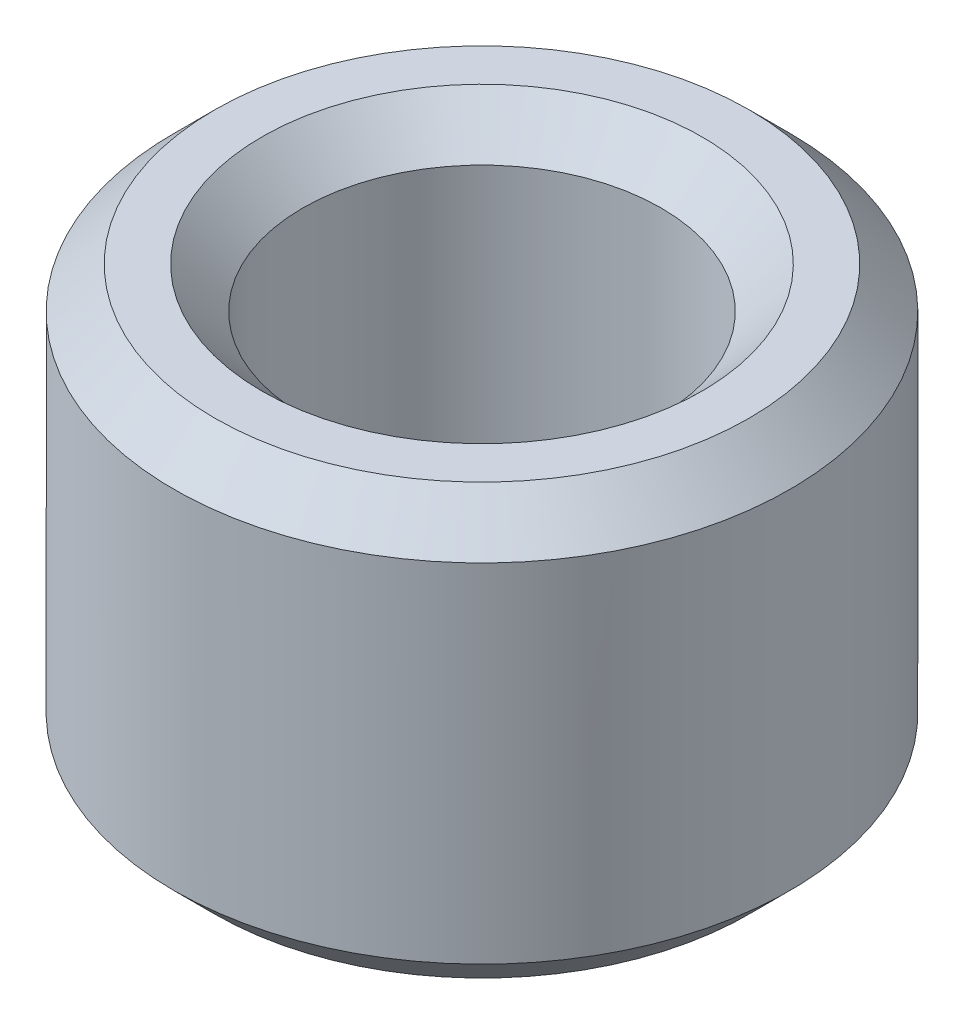
ISO-10303-21;
HEADER;
FILE_DESCRIPTION(('STEP AP214'),'2;1');
FILE_NAME('part.step','',(''),(''),'','','');
FILE_SCHEMA(('AUTOMOTIVE_DESIGN { 1 0 10303 214 1 1 1 1 }'));
ENDSEC;
DATA;
#1=APPLICATION_CONTEXT('core data for automotive mechanical design processes');
#2=APPLICATION_PROTOCOL_DEFINITION('international standard','automotive_design',2000,#1);
#3=PRODUCT_CONTEXT('',#1,'mechanical');
#4=PRODUCT('Part','Part','',(#3));
#5=PRODUCT_RELATED_PRODUCT_CATEGORY('part','',(#4));
#6=PRODUCT_DEFINITION_FORMATION('','',#4);
#7=PRODUCT_DEFINITION_CONTEXT('part definition',#1,'design');
#8=PRODUCT_DEFINITION('design','',#6,#7);
#9=PRODUCT_DEFINITION_SHAPE('','',#8);
#10=(LENGTH_UNIT() NAMED_UNIT(*) SI_UNIT(.MILLI.,.METRE.));
#11=(NAMED_UNIT(*) PLANE_ANGLE_UNIT() SI_UNIT($,.RADIAN.));
#12=(NAMED_UNIT(*) SI_UNIT($,.STERADIAN.) SOLID_ANGLE_UNIT());
#13=UNCERTAINTY_MEASURE_WITH_UNIT(LENGTH_MEASURE(1.E-05),#10,'distance_accuracy_value','');
#14=(GEOMETRIC_REPRESENTATION_CONTEXT(3) GLOBAL_UNCERTAINTY_ASSIGNED_CONTEXT((#13)) GLOBAL_UNIT_ASSIGNED_CONTEXT((#10,
#11,#12)) REPRESENTATION_CONTEXT('',''));
#15=CARTESIAN_POINT('',(0.,0.,0.));
#16=DIRECTION('',(0.,0.,1.));
#17=DIRECTION('',(1.,0.,0.));
#18=AXIS2_PLACEMENT_3D('',#15,#16,#17);
#19=CARTESIAN_POINT('',(0.,27.8746559785749,0.));
#20=DIRECTION('',(0.,-1.,0.));
#21=DIRECTION('',(0.,0.,-1.));
#22=AXIS2_PLACEMENT_3D('',#19,#20,#21);
#23=CYLINDRICAL_SURFACE('',#22,20.);
#24=CARTESIAN_POINT('',(0.,2.66226070512291,0.));
#25=DIRECTION('',(0.,1.,0.));
#26=DIRECTION('',(0.,0.,1.));
#27=AXIS2_PLACEMENT_3D('',#24,#25,#26);
#28=CIRCLE('',#27,20.);
#29=CARTESIAN_POINT('',(0.,2.66226070512291,-20.));
#30=VERTEX_POINT('',#29);
#31=EDGE_CURVE('E10',#30,#30,#28,.T.);
#32=CARTESIAN_POINT('',(0.,25.212395273452,0.));
#33=DIRECTION('',(0.,1.,0.));
#34=DIRECTION('',(0.,0.,1.));
#35=AXIS2_PLACEMENT_3D('',#32,#33,#34);
#36=CIRCLE('',#35,20.);
#37=CARTESIAN_POINT('',(0.,25.212395273452,-20.));
#38=VERTEX_POINT('',#37);
#39=EDGE_CURVE('E50',#38,#38,#36,.F.);
#40=CARTESIAN_POINT('',(0.,2.66226070512291,-20.));
#41=CARTESIAN_POINT('',(0.,2.89715794020967,-20.));
#42=CARTESIAN_POINT('',(0.,3.13205517529643,-20.));
#43=CARTESIAN_POINT('',(0.,3.60184964546995,-20.));
#44=CARTESIAN_POINT('',(0.,3.83674688055671,-20.));
#45=CARTESIAN_POINT('',(0.,4.30654135073024,-20.));
#46=CARTESIAN_POINT('',(0.,4.541438585817,-20.));
#47=CARTESIAN_POINT('',(0.,5.01123305599052,-20.));
#48=CARTESIAN_POINT('',(0.,5.24613029107728,-20.));
#49=CARTESIAN_POINT('',(0.,5.7159247612508,-20.));
#50=CARTESIAN_POINT('',(0.,5.95082199633757,-20.));
#51=CARTESIAN_POINT('',(0.,6.42061646651109,-20.));
#52=CARTESIAN_POINT('',(0.,6.65551370159785,-20.));
#53=CARTESIAN_POINT('',(0.,7.12530817177137,-20.));
#54=CARTESIAN_POINT('',(0.,7.36020540685813,-20.));
#55=CARTESIAN_POINT('',(0.,7.82999987703166,-20.));
#56=CARTESIAN_POINT('',(0.,8.06489711211842,-20.));
#57=CARTESIAN_POINT('',(0.,8.53469158229194,-20.));
#58=CARTESIAN_POINT('',(0.,8.7695888173787,-20.));
#59=CARTESIAN_POINT('',(0.,9.23938328755222,-20.));
#60=CARTESIAN_POINT('',(0.,9.47428052263898,-20.));
#61=CARTESIAN_POINT('',(0.,9.94407499281251,-20.));
#62=CARTESIAN_POINT('',(0.,10.1789722278993,-20.));
#63=CARTESIAN_POINT('',(0.,10.6487666980728,-20.));
#64=CARTESIAN_POINT('',(0.,10.8836639331596,-20.));
#65=CARTESIAN_POINT('',(0.,11.3534584033331,-20.));
#66=CARTESIAN_POINT('',(0.,11.5883556384198,-20.));
#67=CARTESIAN_POINT('',(0.,12.0581501085934,-20.));
#68=CARTESIAN_POINT('',(0.,12.2930473436801,-20.));
#69=CARTESIAN_POINT('',(0.,12.7628418138536,-20.));
#70=CARTESIAN_POINT('',(0.,12.9977390489404,-20.));
#71=CARTESIAN_POINT('',(0.,13.4675335191139,-20.));
#72=CARTESIAN_POINT('',(0.,13.7024307542007,-20.));
#73=CARTESIAN_POINT('',(0.,14.1722252243742,-20.));
#74=CARTESIAN_POINT('',(0.,14.407122459461,-20.));
#75=CARTESIAN_POINT('',(0.,14.8769169296345,-20.));
#76=CARTESIAN_POINT('',(0.,15.1118141647213,-20.));
#77=CARTESIAN_POINT('',(0.,15.5816086348948,-20.));
#78=CARTESIAN_POINT('',(0.,15.8165058699815,-20.));
#79=CARTESIAN_POINT('',(0.,16.2863003401551,-20.));
#80=CARTESIAN_POINT('',(0.,16.5211975752418,-20.));
#81=CARTESIAN_POINT('',(0.,16.9909920454153,-20.));
#82=CARTESIAN_POINT('',(0.,17.2258892805021,-20.));
#83=CARTESIAN_POINT('',(0.,17.6956837506756,-20.));
#84=CARTESIAN_POINT('',(0.,17.9305809857624,-20.));
#85=CARTESIAN_POINT('',(0.,18.4003754559359,-20.));
#86=CARTESIAN_POINT('',(0.,18.6352726910227,-20.));
#87=CARTESIAN_POINT('',(0.,19.1050671611962,-20.));
#88=CARTESIAN_POINT('',(0.,19.339964396283,-20.));
#89=CARTESIAN_POINT('',(0.,19.8097588664565,-20.));
#90=CARTESIAN_POINT('',(0.,20.0446561015432,-20.));
#91=CARTESIAN_POINT('',(0.,20.5144505717168,-20.));
#92=CARTESIAN_POINT('',(0.,20.7493478068035,-20.));
#93=CARTESIAN_POINT('',(0.,21.219142276977,-20.));
#94=CARTESIAN_POINT('',(0.,21.4540395120638,-20.));
#95=CARTESIAN_POINT('',(0.,21.9238339822373,-20.));
#96=CARTESIAN_POINT('',(0.,22.1587312173241,-20.));
#97=CARTESIAN_POINT('',(0.,22.6285256874976,-20.));
#98=CARTESIAN_POINT('',(0.,22.8634229225844,-20.));
#99=CARTESIAN_POINT('',(0.,23.3332173927579,-20.));
#100=CARTESIAN_POINT('',(0.,23.5681146278447,-20.));
#101=CARTESIAN_POINT('',(0.,24.0379090980182,-20.));
#102=CARTESIAN_POINT('',(0.,24.2728063331049,-20.));
#103=CARTESIAN_POINT('',(0.,24.7426008032785,-20.));
#104=CARTESIAN_POINT('',(0.,24.9774980383652,-20.));
#105=CARTESIAN_POINT('',(0.,25.212395273452,-20.));
#106=B_SPLINE_CURVE_WITH_KNOTS('',3,(#40,#41,#42,#43,#44,#45,#46,#47,#48,#49,#50,#51,#52,#53,
#54,#55,#56,#57,#58,#59,#60,#61,#62,#63,#64,#65,#66,#67,#68,#69,#70,#71,#72,#73,#74,#75,#76,#77,
#78,#79,#80,#81,#82,#83,#84,#85,#86,#87,#88,#89,#90,#91,#92,#93,#94,#95,#96,#97,#98,#99,#100,
#101,#102,#103,#104,#105),.UNSPECIFIED.,.F.,.F.,(4,2,2,2,2,2,2,2,2,2,2,2,2,2,2,2,2,2,2,2,2,2,2,
2,2,2,2,2,2,2,2,2,4),(0.,0.704691705260285,1.40938341052057,2.11407511578085,2.81876682104113,
3.52345852630142,4.2281502315617,4.93284193682199,5.63753364208227,6.34222534734255,
7.04691705260284,7.75160875786312,8.45630046312341,9.16099216838369,9.86568387364397,
10.5703755789043,11.2750672841645,11.9797589894248,12.6844506946851,13.3891423999454,
14.0938341052057,14.798525810466,15.5032175157262,16.2079092209865,16.9126009262468,
17.6172926315071,18.3219843367674,19.0266760420277,19.7313677472879,20.4360594525482,
21.1407511578085,21.8454428630688,22.5501345683291),.UNSPECIFIED.);
#107=EDGE_CURVE('BSEAM39',#30,#38,#106,.T.);
#108=ORIENTED_EDGE('',*,*,#31,.T.);
#109=ORIENTED_EDGE('',*,*,#39,.T.);
#110=ORIENTED_EDGE('',*,*,#107,.T.);
#111=ORIENTED_EDGE('',*,*,#107,.F.);
#112=EDGE_LOOP('',(#108,#110,#109,#111));
#113=FACE_BOUND('',#112,.T.);
#114=ADVANCED_FACE('F39',(#113),#23,.T.);
#115=CARTESIAN_POINT('',(0.,27.8746559785749,0.));
#116=DIRECTION('',(0.,1.,0.));
#117=DIRECTION('',(0.,0.,1.));
#118=AXIS2_PLACEMENT_3D('',#115,#116,#117);
#119=PLANE('',#118);
#120=CARTESIAN_POINT('',(0.,27.8746559785749,0.));
#121=DIRECTION('',(0.,1.,0.));
#122=DIRECTION('',(0.,0.,1.));
#123=AXIS2_PLACEMENT_3D('',#120,#121,#122);
#124=CIRCLE('',#123,14.2882982925674);
#125=CARTESIAN_POINT('',(0.,27.8746559785749,14.2882982925674));
#126=VERTEX_POINT('',#125);
#127=EDGE_CURVE('E58',#126,#126,#124,.F.);
#128=ORIENTED_EDGE('',*,*,#127,.T.);
#129=EDGE_LOOP('',(#128));
#130=FACE_BOUND('',#129,.T.);
#131=CARTESIAN_POINT('',(0.,27.8746559785749,0.));
#132=DIRECTION('',(0.,1.,0.));
#133=DIRECTION('',(0.,0.,1.));
#134=AXIS2_PLACEMENT_3D('',#131,#132,#133);
#135=CIRCLE('',#134,17.3377392948772);
#136=CARTESIAN_POINT('',(0.,27.8746559785749,17.3377392948772));
#137=VERTEX_POINT('',#136);
#138=EDGE_CURVE('E61',#137,#137,#135,.T.);
#139=ORIENTED_EDGE('',*,*,#138,.T.);
#140=EDGE_LOOP('',(#139));
#141=FACE_BOUND('',#140,.T.);
#142=ADVANCED_FACE('F88',(#130,#141),#119,.T.);
#143=CARTESIAN_POINT('',(0.,0.,0.));
#144=DIRECTION('',(0.,1.,0.));
#145=DIRECTION('',(0.,0.,1.));
#146=AXIS2_PLACEMENT_3D('',#143,#144,#145);
#147=PLANE('',#146);
#148=CARTESIAN_POINT('',(0.,0.,0.));
#149=DIRECTION('',(0.,1.,0.));
#150=DIRECTION('',(0.,0.,1.));
#151=AXIS2_PLACEMENT_3D('',#148,#149,#150);
#152=CIRCLE('',#151,14.2882982925673);
#153=CARTESIAN_POINT('',(0.,0.,14.2882982925673));
#154=VERTEX_POINT('',#153);
#155=EDGE_CURVE('E51',#154,#154,#152,.T.);
#156=ORIENTED_EDGE('',*,*,#155,.T.);
#157=EDGE_LOOP('',(#156));
#158=FACE_BOUND('',#157,.T.);
#159=CARTESIAN_POINT('',(0.,0.,0.));
#160=DIRECTION('',(0.,1.,0.));
#161=DIRECTION('',(0.,0.,1.));
#162=AXIS2_PLACEMENT_3D('',#159,#160,#161);
#163=CIRCLE('',#162,17.3377392948771);
#164=CARTESIAN_POINT('',(0.,0.,17.3377392948771));
#165=VERTEX_POINT('',#164);
#166=EDGE_CURVE('E54',#165,#165,#163,.F.);
#167=ORIENTED_EDGE('',*,*,#166,.T.);
#168=EDGE_LOOP('',(#167));
#169=FACE_BOUND('',#168,.T.);
#170=ADVANCED_FACE('F83',(#158,#169),#147,.F.);
#171=CARTESIAN_POINT('',(0.,27.8746559785749,0.));
#172=DIRECTION('',(0.,-1.,0.));
#173=DIRECTION('',(0.,0.,-1.));
#174=AXIS2_PLACEMENT_3D('',#171,#172,#173);
#175=CYLINDRICAL_SURFACE('',#174,11.6260375874445);
#176=CARTESIAN_POINT('',(0.,25.212395273452,0.));
#177=DIRECTION('',(0.,1.,0.));
#178=DIRECTION('',(0.,0.,1.));
#179=AXIS2_PLACEMENT_3D('',#176,#177,#178);
#180=CIRCLE('',#179,11.6260375874445);
#181=CARTESIAN_POINT('',(0.,25.212395273452,-11.6260375874445));
#182=VERTEX_POINT('',#181);
#183=EDGE_CURVE('E67',#182,#182,#180,.T.);
#184=CARTESIAN_POINT('',(0.,2.66226070512286,0.));
#185=DIRECTION('',(0.,1.,0.));
#186=DIRECTION('',(0.,0.,1.));
#187=AXIS2_PLACEMENT_3D('',#184,#185,#186);
#188=CIRCLE('',#187,11.6260375874445);
#189=CARTESIAN_POINT('',(0.,2.66226070512286,-11.6260375874445));
#190=VERTEX_POINT('',#189);
#191=EDGE_CURVE('E69',#190,#190,#188,.F.);
#192=CARTESIAN_POINT('',(0.,25.212395273452,-11.6260375874445));
#193=CARTESIAN_POINT('',(0.,24.9774980383652,-11.6260375874445));
#194=CARTESIAN_POINT('',(0.,24.7426008032784,-11.6260375874445));
#195=CARTESIAN_POINT('',(0.,24.2728063331049,-11.6260375874445));
#196=CARTESIAN_POINT('',(0.,24.0379090980182,-11.6260375874445));
#197=CARTESIAN_POINT('',(0.,23.5681146278446,-11.6260375874445));
#198=CARTESIAN_POINT('',(0.,23.3332173927579,-11.6260375874445));
#199=CARTESIAN_POINT('',(0.,22.8634229225844,-11.6260375874445));
#200=CARTESIAN_POINT('',(0.,22.6285256874976,-11.6260375874445));
#201=CARTESIAN_POINT('',(0.,22.1587312173241,-11.6260375874445));
#202=CARTESIAN_POINT('',(0.,21.9238339822373,-11.6260375874445));
#203=CARTESIAN_POINT('',(0.,21.4540395120638,-11.6260375874445));
#204=CARTESIAN_POINT('',(0.,21.219142276977,-11.6260375874445));
#205=CARTESIAN_POINT('',(0.,20.7493478068035,-11.6260375874445));
#206=CARTESIAN_POINT('',(0.,20.5144505717167,-11.6260375874445));
#207=CARTESIAN_POINT('',(0.,20.0446561015432,-11.6260375874445));
#208=CARTESIAN_POINT('',(0.,19.8097588664565,-11.6260375874445));
#209=CARTESIAN_POINT('',(0.,19.3399643962829,-11.6260375874445));
#210=CARTESIAN_POINT('',(0.,19.1050671611962,-11.6260375874445));
#211=CARTESIAN_POINT('',(0.,18.6352726910226,-11.6260375874445));
#212=CARTESIAN_POINT('',(0.,18.4003754559359,-11.6260375874445));
#213=CARTESIAN_POINT('',(0.,17.9305809857624,-11.6260375874445));
#214=CARTESIAN_POINT('',(0.,17.6956837506756,-11.6260375874445));
#215=CARTESIAN_POINT('',(0.,17.2258892805021,-11.6260375874445));
#216=CARTESIAN_POINT('',(0.,16.9909920454153,-11.6260375874445));
#217=CARTESIAN_POINT('',(0.,16.5211975752418,-11.6260375874445));
#218=CARTESIAN_POINT('',(0.,16.286300340155,-11.6260375874445));
#219=CARTESIAN_POINT('',(0.,15.8165058699815,-11.6260375874445));
#220=CARTESIAN_POINT('',(0.,15.5816086348947,-11.6260375874445));
#221=CARTESIAN_POINT('',(0.,15.1118141647212,-11.6260375874445));
#222=CARTESIAN_POINT('',(0.,14.8769169296345,-11.6260375874445));
#223=CARTESIAN_POINT('',(0.,14.4071224594609,-11.6260375874445));
#224=CARTESIAN_POINT('',(0.,14.1722252243742,-11.6260375874445));
#225=CARTESIAN_POINT('',(0.,13.7024307542007,-11.6260375874445));
#226=CARTESIAN_POINT('',(0.,13.4675335191139,-11.6260375874445));
#227=CARTESIAN_POINT('',(0.,12.9977390489404,-11.6260375874445));
#228=CARTESIAN_POINT('',(0.,12.7628418138536,-11.6260375874445));
#229=CARTESIAN_POINT('',(0.,12.2930473436801,-11.6260375874445));
#230=CARTESIAN_POINT('',(0.,12.0581501085933,-11.6260375874445));
#231=CARTESIAN_POINT('',(0.,11.5883556384198,-11.6260375874445));
#232=CARTESIAN_POINT('',(0.,11.353458403333,-11.6260375874445));
#233=CARTESIAN_POINT('',(0.,10.8836639331595,-11.6260375874445));
#234=CARTESIAN_POINT('',(0.,10.6487666980728,-11.6260375874445));
#235=CARTESIAN_POINT('',(0.,10.1789722278992,-11.6260375874445));
#236=CARTESIAN_POINT('',(0.,9.94407499281247,-11.6260375874445));
#237=CARTESIAN_POINT('',(0.,9.47428052263895,-11.6260375874445));
#238=CARTESIAN_POINT('',(0.,9.23938328755218,-11.6260375874445));
#239=CARTESIAN_POINT('',(0.,8.76958881737866,-11.6260375874445));
#240=CARTESIAN_POINT('',(0.,8.5346915822919,-11.6260375874445));
#241=CARTESIAN_POINT('',(0.,8.06489711211838,-11.6260375874445));
#242=CARTESIAN_POINT('',(0.,7.82999987703162,-11.6260375874445));
#243=CARTESIAN_POINT('',(0.,7.36020540685809,-11.6260375874445));
#244=CARTESIAN_POINT('',(0.,7.12530817177133,-11.6260375874445));
#245=CARTESIAN_POINT('',(0.,6.65551370159781,-11.6260375874445));
#246=CARTESIAN_POINT('',(0.,6.42061646651104,-11.6260375874445));
#247=CARTESIAN_POINT('',(0.,5.95082199633752,-11.6260375874445));
#248=CARTESIAN_POINT('',(0.,5.71592476125076,-11.6260375874445));
#249=CARTESIAN_POINT('',(0.,5.24613029107724,-11.6260375874445));
#250=CARTESIAN_POINT('',(0.,5.01123305599047,-11.6260375874445));
#251=CARTESIAN_POINT('',(0.,4.54143858581695,-11.6260375874445));
#252=CARTESIAN_POINT('',(0.,4.30654135073019,-11.6260375874445));
#253=CARTESIAN_POINT('',(0.,3.83674688055667,-11.6260375874445));
#254=CARTESIAN_POINT('',(0.,3.60184964546991,-11.6260375874445));
#255=CARTESIAN_POINT('',(0.,3.13205517529638,-11.6260375874445));
#256=CARTESIAN_POINT('',(0.,2.89715794020962,-11.6260375874445));
#257=CARTESIAN_POINT('',(0.,2.66226070512286,-11.6260375874445));
#258=B_SPLINE_CURVE_WITH_KNOTS('',3,(#192,#193,#194,#195,#196,#197,#198,#199,#200,#201,#202,
#203,#204,#205,#206,#207,#208,#209,#210,#211,#212,#213,#214,#215,#216,#217,#218,#219,#220,#221,
#222,#223,#224,#225,#226,#227,#228,#229,#230,#231,#232,#233,#234,#235,#236,#237,#238,#239,#240,
#241,#242,#243,#244,#245,#246,#247,#248,#249,#250,#251,#252,#253,#254,#255,#256,#257),
.UNSPECIFIED.,.F.,.F.,(4,2,2,2,2,2,2,2,2,2,2,2,2,2,2,2,2,2,2,2,2,2,2,2,2,2,2,2,2,2,2,2,4),(0.,
0.704691705260285,1.40938341052057,2.11407511578085,2.81876682104114,3.52345852630142,
4.22815023156171,4.93284193682199,5.63753364208228,6.34222534734256,7.04691705260285,
7.75160875786313,8.45630046312342,9.1609921683837,9.86568387364399,10.5703755789043,
11.2750672841646,11.9797589894248,12.6844506946851,13.3891423999454,14.0938341052057,
14.798525810466,15.5032175157263,16.2079092209865,16.9126009262468,17.6172926315071,
18.3219843367674,19.0266760420277,19.731367747288,20.4360594525483,21.1407511578085,
21.8454428630688,22.5501345683291),.UNSPECIFIED.);
#259=EDGE_CURVE('BSEAM71',#182,#190,#258,.T.);
#260=ORIENTED_EDGE('',*,*,#183,.T.);
#261=ORIENTED_EDGE('',*,*,#191,.T.);
#262=ORIENTED_EDGE('',*,*,#259,.T.);
#263=ORIENTED_EDGE('',*,*,#259,.F.);
#264=EDGE_LOOP('',(#260,#262,#261,#263));
#265=FACE_BOUND('',#264,.T.);
#266=ADVANCED_FACE('F71',(#265),#175,.F.);
#267=CARTESIAN_POINT('',(0.,25.212395273452,0.));
#268=DIRECTION('',(0.,1.,0.));
#269=DIRECTION('',(0.,0.,1.));
#270=AXIS2_PLACEMENT_3D('',#267,#268,#269);
#271=CONICAL_SURFACE('',#270,11.6260375874445,0.785398163397452);
#272=ORIENTED_EDGE('',*,*,#127,.F.);
#273=EDGE_LOOP('',(#272));
#274=FACE_BOUND('',#273,.T.);
#275=ORIENTED_EDGE('',*,*,#183,.F.);
#276=EDGE_LOOP('',(#275));
#277=FACE_BOUND('',#276,.T.);
#278=ADVANCED_FACE('F77',(#274,#277),#271,.F.);
#279=CARTESIAN_POINT('',(0.,0.,0.));
#280=DIRECTION('',(0.,-1.,0.));
#281=DIRECTION('',(0.,0.,-1.));
#282=AXIS2_PLACEMENT_3D('',#279,#280,#281);
#283=CONICAL_SURFACE('',#282,14.2882982925673,0.785398163397446);
#284=ORIENTED_EDGE('',*,*,#191,.F.);
#285=EDGE_LOOP('',(#284));
#286=FACE_BOUND('',#285,.T.);
#287=ORIENTED_EDGE('',*,*,#155,.F.);
#288=EDGE_LOOP('',(#287));
#289=FACE_BOUND('',#288,.T.);
#290=ADVANCED_FACE('F73',(#286,#289),#283,.F.);
#291=CARTESIAN_POINT('',(0.,2.66226070512291,0.));
#292=DIRECTION('',(0.,1.,0.));
#293=DIRECTION('',(0.,0.,1.));
#294=AXIS2_PLACEMENT_3D('',#291,#292,#293);
#295=CONICAL_SURFACE('',#294,20.,0.785398163397452);
#296=ORIENTED_EDGE('',*,*,#166,.F.);
#297=EDGE_LOOP('',(#296));
#298=FACE_BOUND('',#297,.T.);
#299=ORIENTED_EDGE('',*,*,#31,.F.);
#300=EDGE_LOOP('',(#299));
#301=FACE_BOUND('',#300,.T.);
#302=ADVANCED_FACE('F76',(#298,#301),#295,.T.);
#303=CARTESIAN_POINT('',(0.,27.8746559785749,0.));
#304=DIRECTION('',(0.,-1.,0.));
#305=DIRECTION('',(0.,0.,-1.));
#306=AXIS2_PLACEMENT_3D('',#303,#304,#305);
#307=CONICAL_SURFACE('',#306,17.3377392948772,0.785398163397444);
#308=ORIENTED_EDGE('',*,*,#39,.F.);
#309=EDGE_LOOP('',(#308));
#310=FACE_BOUND('',#309,.T.);
#311=ORIENTED_EDGE('',*,*,#138,.F.);
#312=EDGE_LOOP('',(#311));
#313=FACE_BOUND('',#312,.T.);
#314=ADVANCED_FACE('F45',(#310,#313),#307,.T.);
#315=CLOSED_SHELL('',(#114,#142,#170,#266,#278,#290,#302,#314));
#316=MANIFOLD_SOLID_BREP('B2',#315);
#317=ADVANCED_BREP_SHAPE_REPRESENTATION('',(#18,#316),#14);
#318=SHAPE_DEFINITION_REPRESENTATION(#9,#317);
ENDSEC;
END-ISO-10303-21;
